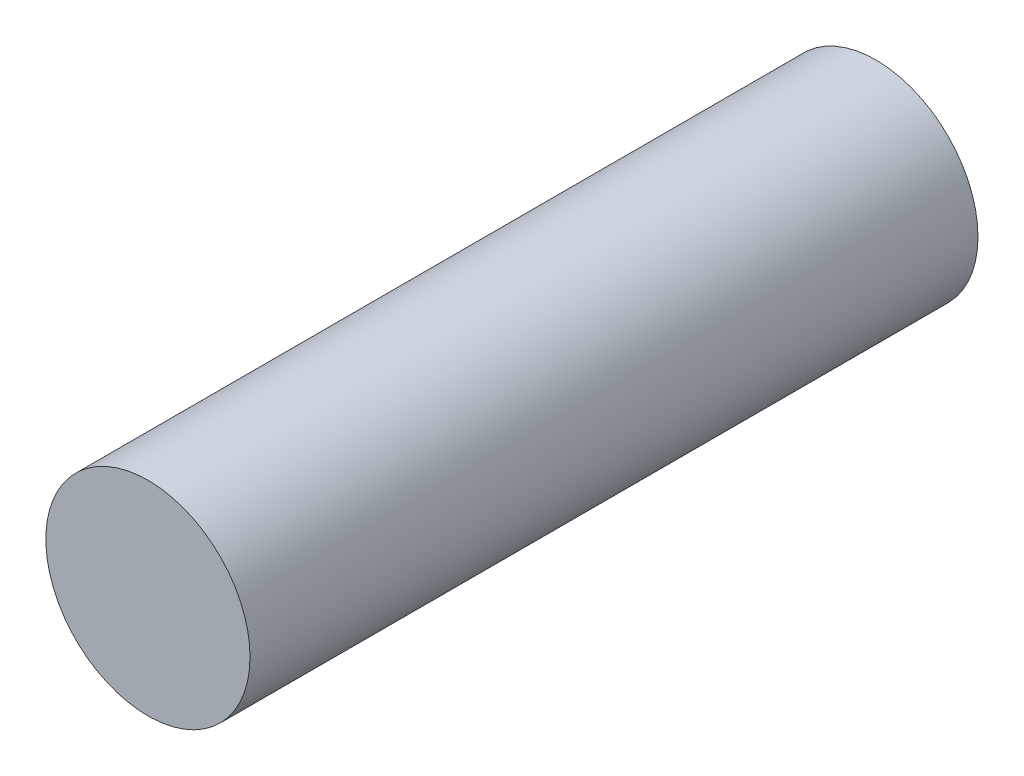
ISO-10303-21;
HEADER;
FILE_DESCRIPTION(('STEP AP214'),'2;1');
FILE_NAME('part.step','',(''),(''),'','','');
FILE_SCHEMA(('AUTOMOTIVE_DESIGN { 1 0 10303 214 1 1 1 1 }'));
ENDSEC;
DATA;
#1=APPLICATION_CONTEXT('core data for automotive mechanical design processes');
#2=APPLICATION_PROTOCOL_DEFINITION('international standard','automotive_design',2000,#1);
#3=PRODUCT_CONTEXT('',#1,'mechanical');
#4=PRODUCT('Part','Part','',(#3));
#5=PRODUCT_RELATED_PRODUCT_CATEGORY('part','',(#4));
#6=PRODUCT_DEFINITION_FORMATION('','',#4);
#7=PRODUCT_DEFINITION_CONTEXT('part definition',#1,'design');
#8=PRODUCT_DEFINITION('design','',#6,#7);
#9=PRODUCT_DEFINITION_SHAPE('','',#8);
#10=(LENGTH_UNIT() NAMED_UNIT(*) SI_UNIT(.MILLI.,.METRE.));
#11=(NAMED_UNIT(*) PLANE_ANGLE_UNIT() SI_UNIT($,.RADIAN.));
#12=(NAMED_UNIT(*) SI_UNIT($,.STERADIAN.) SOLID_ANGLE_UNIT());
#13=UNCERTAINTY_MEASURE_WITH_UNIT(LENGTH_MEASURE(1.E-05),#10,'distance_accuracy_value','');
#14=(GEOMETRIC_REPRESENTATION_CONTEXT(3) GLOBAL_UNCERTAINTY_ASSIGNED_CONTEXT((#13)) GLOBAL_UNIT_ASSIGNED_CONTEXT((#10,
#11,#12)) REPRESENTATION_CONTEXT('',''));
#15=CARTESIAN_POINT('',(0.,0.,0.));
#16=DIRECTION('',(0.,0.,1.));
#17=DIRECTION('',(1.,0.,0.));
#18=AXIS2_PLACEMENT_3D('',#15,#16,#17);
#19=CARTESIAN_POINT('',(0.,0.,-65.0875));
#20=DIRECTION('',(0.,0.,1.));
#21=DIRECTION('',(-1.,0.,0.));
#22=AXIS2_PLACEMENT_3D('',#19,#20,#21);
#23=CYLINDRICAL_SURFACE('',#22,18.25625);
#24=CARTESIAN_POINT('',(0.,0.,-65.0875));
#25=DIRECTION('',(0.,0.,1.));
#26=DIRECTION('',(1.,0.,0.));
#27=AXIS2_PLACEMENT_3D('',#24,#25,#26);
#28=CIRCLE('',#27,18.25625);
#29=CARTESIAN_POINT('',(18.25625,0.,-65.0875));
#30=VERTEX_POINT('',#29);
#31=EDGE_CURVE('E10',#30,#30,#28,.T.);
#32=ORIENTED_EDGE('',*,*,#31,.T.);
#33=EDGE_LOOP('',(#32));
#34=FACE_BOUND('',#33,.T.);
#35=CARTESIAN_POINT('',(0.,0.,65.0875));
#36=DIRECTION('',(0.,0.,1.));
#37=DIRECTION('',(1.,0.,0.));
#38=AXIS2_PLACEMENT_3D('',#35,#36,#37);
#39=CIRCLE('',#38,18.25625);
#40=CARTESIAN_POINT('',(18.25625,0.,65.0875));
#41=VERTEX_POINT('',#40);
#42=EDGE_CURVE('E40',#41,#41,#39,.T.);
#43=ORIENTED_EDGE('',*,*,#42,.F.);
#44=EDGE_LOOP('',(#43));
#45=FACE_BOUND('',#44,.T.);
#46=ADVANCED_FACE('F37',(#34,#45),#23,.T.);
#47=CARTESIAN_POINT('',(0.,0.,-65.0875));
#48=DIRECTION('',(0.,0.,-1.));
#49=DIRECTION('',(1.,0.,0.));
#50=AXIS2_PLACEMENT_3D('',#47,#48,#49);
#51=PLANE('',#50);
#52=ORIENTED_EDGE('',*,*,#31,.F.);
#53=EDGE_LOOP('',(#52));
#54=FACE_BOUND('',#53,.T.);
#55=ADVANCED_FACE('F52',(#54),#51,.T.);
#56=CARTESIAN_POINT('',(0.,0.,65.0875));
#57=DIRECTION('',(0.,0.,-1.));
#58=DIRECTION('',(1.,0.,0.));
#59=AXIS2_PLACEMENT_3D('',#56,#57,#58);
#60=PLANE('',#59);
#61=ORIENTED_EDGE('',*,*,#42,.T.);
#62=EDGE_LOOP('',(#61));
#63=FACE_BOUND('',#62,.T.);
#64=ADVANCED_FACE('F49',(#63),#60,.F.);
#65=CLOSED_SHELL('',(#46,#55,#64));
#66=MANIFOLD_SOLID_BREP('B2',#65);
#67=ADVANCED_BREP_SHAPE_REPRESENTATION('',(#18,#66),#14);
#68=SHAPE_DEFINITION_REPRESENTATION(#9,#67);
ENDSEC;
END-ISO-10303-21;
